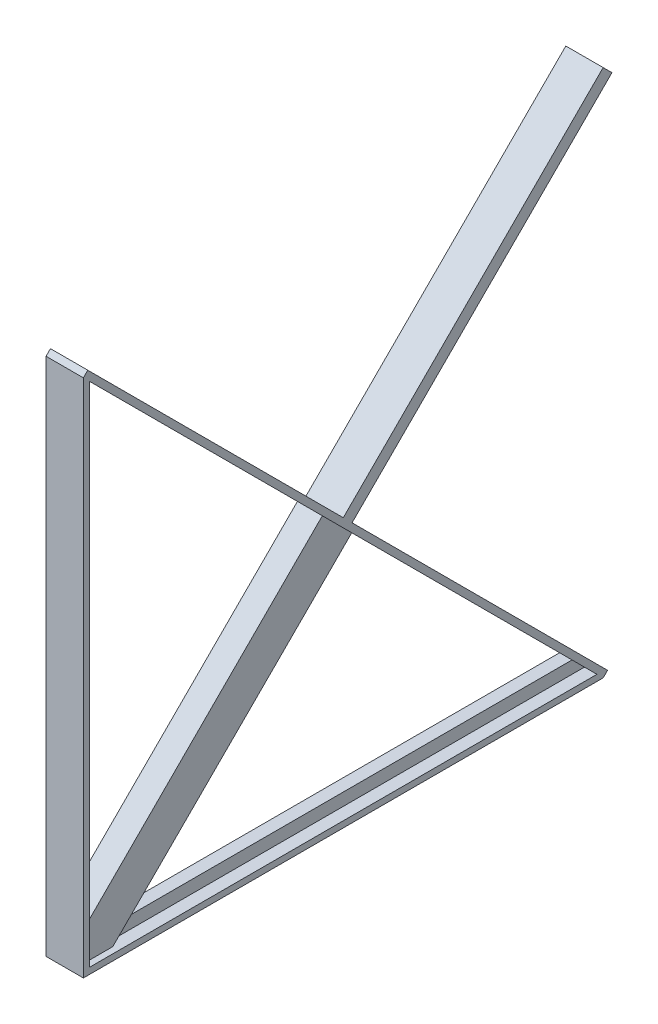
ISO-10303-21;
HEADER;
FILE_DESCRIPTION(('STEP AP214'),'2;1');
FILE_NAME('part.step','',(''),(''),'','','');
FILE_SCHEMA(('AUTOMOTIVE_DESIGN { 1 0 10303 214 1 1 1 1 }'));
ENDSEC;
DATA;
#1=APPLICATION_CONTEXT('core data for automotive mechanical design processes');
#2=APPLICATION_PROTOCOL_DEFINITION('international standard','automotive_design',2000,#1);
#3=PRODUCT_CONTEXT('',#1,'mechanical');
#4=PRODUCT('Part','Part','',(#3));
#5=PRODUCT_RELATED_PRODUCT_CATEGORY('part','',(#4));
#6=PRODUCT_DEFINITION_FORMATION('','',#4);
#7=PRODUCT_DEFINITION_CONTEXT('part definition',#1,'design');
#8=PRODUCT_DEFINITION('design','',#6,#7);
#9=PRODUCT_DEFINITION_SHAPE('','',#8);
#10=(LENGTH_UNIT() NAMED_UNIT(*) SI_UNIT(.MILLI.,.METRE.));
#11=(NAMED_UNIT(*) PLANE_ANGLE_UNIT() SI_UNIT($,.RADIAN.));
#12=(NAMED_UNIT(*) SI_UNIT($,.STERADIAN.) SOLID_ANGLE_UNIT());
#13=UNCERTAINTY_MEASURE_WITH_UNIT(LENGTH_MEASURE(1.E-05),#10,'distance_accuracy_value','');
#14=(GEOMETRIC_REPRESENTATION_CONTEXT(3) GLOBAL_UNCERTAINTY_ASSIGNED_CONTEXT((#13)) GLOBAL_UNIT_ASSIGNED_CONTEXT((#10,
#11,#12)) REPRESENTATION_CONTEXT('',''));
#15=CARTESIAN_POINT('',(0.,0.,0.));
#16=DIRECTION('',(0.,0.,1.));
#17=DIRECTION('',(1.,0.,0.));
#18=AXIS2_PLACEMENT_3D('',#15,#16,#17);
#19=CARTESIAN_POINT('',(0.,1078.62051224214,-1078.62051224214));
#20=DIRECTION('',(0.,-0.707106781186549,0.707106781186546));
#21=DIRECTION('',(0.,-0.707106781186546,-0.707106781186549));
#22=AXIS2_PLACEMENT_3D('',#19,#20,#21);
#23=PLANE('',#22);
#24=DIRECTION('',(1.,0.,0.));
#25=VECTOR('',#24,1.);
#26=CARTESIAN_POINT('',(76.2,1096.58102448428,-1060.66));
#27=LINE('',#26,#25);
#28=CARTESIAN_POINT('',(-76.2,1096.58102448428,-1060.66));
#29=VERTEX_POINT('',#28);
#30=CARTESIAN_POINT('',(76.2,1096.58102448428,-1060.66));
#31=VERTEX_POINT('',#30);
#32=EDGE_CURVE('E756',#29,#31,#27,.T.);
#33=ORIENTED_EDGE('',*,*,#32,.F.);
#34=DIRECTION('',(0.,0.707106781186546,0.707106781186549));
#35=VECTOR('',#34,1.);
#36=CARTESIAN_POINT('',(-76.2,2139.28051224214,-17.9605122421383));
#37=LINE('',#36,#35);
#38=CARTESIAN_POINT('',(-76.2,2139.28051224214,-17.9605122421383));
#39=VERTEX_POINT('',#38);
#40=EDGE_CURVE('E234',#29,#39,#37,.T.);
#41=ORIENTED_EDGE('',*,*,#40,.T.);
#42=DIRECTION('',(1.,0.,0.));
#43=VECTOR('',#42,1.);
#44=CARTESIAN_POINT('',(-76.2,2139.28051224214,-17.9605122421383));
#45=LINE('',#44,#43);
#46=CARTESIAN_POINT('',(76.2,2139.28051224214,-17.9605122421383));
#47=VERTEX_POINT('',#46);
#48=EDGE_CURVE('E321',#39,#47,#45,.T.);
#49=ORIENTED_EDGE('',*,*,#48,.T.);
#50=DIRECTION('',(0.,-0.707106781186546,-0.707106781186549));
#51=VECTOR('',#50,1.);
#52=CARTESIAN_POINT('',(76.2,2139.28051224214,-17.9605122421383));
#53=LINE('',#52,#51);
#54=EDGE_CURVE('E65',#47,#31,#53,.T.);
#55=ORIENTED_EDGE('',*,*,#54,.T.);
#56=EDGE_LOOP('',(#33,#41,#49,#55));
#57=FACE_BOUND('',#56,.T.);
#58=ADVANCED_FACE('F39',(#57),#23,.F.);
#59=DIRECTION('',(-1.,0.,0.));
#60=VECTOR('',#59,1.);
#61=CARTESIAN_POINT('',(76.2,1060.66000000001,-1096.58102448428));
#62=LINE('',#61,#60);
#63=CARTESIAN_POINT('',(76.2,1060.66000000001,-1096.58102448428));
#64=VERTEX_POINT('',#63);
#65=CARTESIAN_POINT('',(-76.2,1060.66000000001,-1096.58102448428));
#66=VERTEX_POINT('',#65);
#67=EDGE_CURVE('E57',#64,#66,#62,.T.);
#68=ORIENTED_EDGE('',*,*,#67,.F.);
#69=CARTESIAN_POINT('',(76.2,17.9605122421441,-2139.28051224214));
#70=VERTEX_POINT('',#69);
#71=EDGE_CURVE('E324',#64,#70,#53,.T.);
#72=ORIENTED_EDGE('',*,*,#71,.T.);
#73=DIRECTION('',(-1.,0.,0.));
#74=VECTOR('',#73,1.);
#75=CARTESIAN_POINT('',(-76.2,17.9605122421441,-2139.28051224214));
#76=LINE('',#75,#74);
#77=CARTESIAN_POINT('',(-76.2,17.9605122421441,-2139.28051224214));
#78=VERTEX_POINT('',#77);
#79=EDGE_CURVE('E327',#70,#78,#76,.T.);
#80=ORIENTED_EDGE('',*,*,#79,.T.);
#81=EDGE_CURVE('E318',#78,#66,#37,.T.);
#82=ORIENTED_EDGE('',*,*,#81,.T.);
#83=EDGE_LOOP('',(#68,#72,#80,#82));
#84=FACE_BOUND('',#83,.T.);
#85=ADVANCED_FACE('F471',(#84),#23,.F.);
#86=CARTESIAN_POINT('',(-25.4,0.,0.));
#87=DIRECTION('',(1.,0.,0.));
#88=DIRECTION('',(0.,0.,-1.));
#89=AXIS2_PLACEMENT_3D('',#86,#87,#88);
#90=PLANE('',#89);
#91=DIRECTION('',(0.,1.,0.));
#92=VECTOR('',#91,1.);
#93=CARTESIAN_POINT('',(-25.4,2045.12,-76.2));
#94=LINE('',#93,#92);
#95=CARTESIAN_POINT('',(-25.4,196.2,-76.2000000000004));
#96=VERTEX_POINT('',#95);
#97=CARTESIAN_POINT('',(-25.4,2045.12,-76.2));
#98=VERTEX_POINT('',#97);
#99=EDGE_CURVE('E389',#96,#98,#94,.T.);
#100=ORIENTED_EDGE('',*,*,#99,.F.);
#101=DIRECTION('',(0.,-0.707106781186548,0.707106781186548));
#102=VECTOR('',#101,1.);
#103=CARTESIAN_POINT('',(-25.4,59.9999999999999,59.9999999999999));
#104=LINE('',#103,#102);
#105=CARTESIAN_POINT('',(-25.4,145.400000000001,-25.4000000000004));
#106=VERTEX_POINT('',#105);
#107=EDGE_CURVE('E314',#96,#106,#104,.T.);
#108=ORIENTED_EDGE('',*,*,#107,.T.);
#109=DIRECTION('',(0.,-1.,0.));
#110=VECTOR('',#109,1.);
#111=CARTESIAN_POINT('',(-25.4,2095.92,-25.4));
#112=LINE('',#111,#110);
#113=CARTESIAN_POINT('',(-25.4,2095.92,-25.4000000000001));
#114=VERTEX_POINT('',#113);
#115=EDGE_CURVE('E375',#114,#106,#112,.T.);
#116=ORIENTED_EDGE('',*,*,#115,.F.);
#117=DIRECTION('',(0.,0.707106781186549,0.707106781186546));
#118=VECTOR('',#117,1.);
#119=CARTESIAN_POINT('',(-25.4,2045.12,-76.2));
#120=LINE('',#119,#118);
#121=EDGE_CURVE('E372',#98,#114,#120,.T.);
#122=ORIENTED_EDGE('',*,*,#121,.F.);
#123=EDGE_LOOP('',(#100,#108,#116,#122));
#124=FACE_BOUND('',#123,.T.);
#125=ADVANCED_FACE('F512',(#124),#90,.F.);
#126=CARTESIAN_POINT('',(25.4,0.,0.));
#127=DIRECTION('',(1.,0.,0.));
#128=DIRECTION('',(0.,0.,-1.));
#129=AXIS2_PLACEMENT_3D('',#126,#127,#128);
#130=PLANE('',#129);
#131=DIRECTION('',(0.,-0.707106781186548,0.707106781186548));
#132=VECTOR('',#131,1.);
#133=CARTESIAN_POINT('',(25.4,59.9999999999999,59.9999999999999));
#134=LINE('',#133,#132);
#135=CARTESIAN_POINT('',(25.4,196.2,-76.2000000000004));
#136=VERTEX_POINT('',#135);
#137=CARTESIAN_POINT('',(25.4,145.400000000001,-25.4000000000004));
#138=VERTEX_POINT('',#137);
#139=EDGE_CURVE('E306',#136,#138,#134,.T.);
#140=ORIENTED_EDGE('',*,*,#139,.F.);
#141=DIRECTION('',(0.,1.,0.));
#142=VECTOR('',#141,1.);
#143=CARTESIAN_POINT('',(25.4,2045.12,-76.2));
#144=LINE('',#143,#142);
#145=CARTESIAN_POINT('',(25.4,2045.12,-76.2000000000002));
#146=VERTEX_POINT('',#145);
#147=EDGE_CURVE('E369',#136,#146,#144,.T.);
#148=ORIENTED_EDGE('',*,*,#147,.T.);
#149=DIRECTION('',(0.,0.707106781186549,0.707106781186546));
#150=VECTOR('',#149,1.);
#151=CARTESIAN_POINT('',(25.4,2045.12,-76.2));
#152=LINE('',#151,#150);
#153=CARTESIAN_POINT('',(25.4,2095.92,-25.4));
#154=VERTEX_POINT('',#153);
#155=EDGE_CURVE('E351',#146,#154,#152,.T.);
#156=ORIENTED_EDGE('',*,*,#155,.T.);
#157=DIRECTION('',(0.,-1.,0.));
#158=VECTOR('',#157,1.);
#159=CARTESIAN_POINT('',(25.4,2095.92,-25.4));
#160=LINE('',#159,#158);
#161=EDGE_CURVE('E355',#154,#138,#160,.T.);
#162=ORIENTED_EDGE('',*,*,#161,.T.);
#163=EDGE_LOOP('',(#140,#148,#156,#162));
#164=FACE_BOUND('',#163,.T.);
#165=ADVANCED_FACE('F502',(#164),#130,.T.);
#166=CARTESIAN_POINT('',(-76.2,2095.92,-25.4));
#167=DIRECTION('',(0.,0.,-1.));
#168=DIRECTION('',(0.,1.,0.));
#169=AXIS2_PLACEMENT_3D('',#166,#167,#168);
#170=PLANE('',#169);
#171=DIRECTION('',(1.,0.,0.));
#172=VECTOR('',#171,1.);
#173=CARTESIAN_POINT('',(-50.8,145.4,-25.4000000000002));
#174=LINE('',#173,#172);
#175=CARTESIAN_POINT('',(-50.8,145.4,-25.4000000000002));
#176=VERTEX_POINT('',#175);
#177=EDGE_CURVE('E279',#176,#106,#174,.T.);
#178=ORIENTED_EDGE('',*,*,#177,.F.);
#179=DIRECTION('',(0.,-1.,0.));
#180=VECTOR('',#179,1.);
#181=CARTESIAN_POINT('',(-50.8,25.4,-25.4000000000002));
#182=LINE('',#181,#180);
#183=CARTESIAN_POINT('',(-50.8,25.4,-25.4000000000002));
#184=VERTEX_POINT('',#183);
#185=EDGE_CURVE('E275',#176,#184,#182,.T.);
#186=ORIENTED_EDGE('',*,*,#185,.T.);
#187=DIRECTION('',(1.,0.,0.));
#188=VECTOR('',#187,1.);
#189=CARTESIAN_POINT('',(-76.2,25.4,-25.4000000000002));
#190=LINE('',#189,#188);
#191=CARTESIAN_POINT('',(-76.2,25.4,-25.4000000000002));
#192=VERTEX_POINT('',#191);
#193=EDGE_CURVE('E438',#192,#184,#190,.T.);
#194=ORIENTED_EDGE('',*,*,#193,.F.);
#195=DIRECTION('',(0.,1.,0.));
#196=VECTOR('',#195,1.);
#197=CARTESIAN_POINT('',(-76.2,2095.92,-25.4));
#198=LINE('',#197,#196);
#199=CARTESIAN_POINT('',(-76.2,2095.92,-25.3999999999999));
#200=VERTEX_POINT('',#199);
#201=EDGE_CURVE('E423',#192,#200,#198,.T.);
#202=ORIENTED_EDGE('',*,*,#201,.T.);
#203=DIRECTION('',(1.,0.,0.));
#204=VECTOR('',#203,1.);
#205=CARTESIAN_POINT('',(-76.2,2095.92,-25.4));
#206=LINE('',#205,#204);
#207=EDGE_CURVE('E433',#200,#114,#206,.T.);
#208=ORIENTED_EDGE('',*,*,#207,.T.);
#209=ORIENTED_EDGE('',*,*,#115,.T.);
#210=EDGE_LOOP('',(#178,#186,#194,#202,#208,#209));
#211=FACE_BOUND('',#210,.T.);
#212=ADVANCED_FACE('F514',(#211),#170,.T.);
#213=CARTESIAN_POINT('',(-76.2,25.4,-25.4000000000002));
#214=DIRECTION('',(0.,1.,0.));
#215=DIRECTION('',(0.,0.,1.));
#216=AXIS2_PLACEMENT_3D('',#213,#214,#215);
#217=PLANE('',#216);
#218=DIRECTION('',(1.,0.,0.));
#219=VECTOR('',#218,1.);
#220=CARTESIAN_POINT('',(-50.8,25.4,-145.4));
#221=LINE('',#220,#219);
#222=CARTESIAN_POINT('',(-50.8,25.4,-145.4));
#223=VERTEX_POINT('',#222);
#224=CARTESIAN_POINT('',(-25.4,25.4,-145.4));
#225=VERTEX_POINT('',#224);
#226=EDGE_CURVE('E293',#223,#225,#221,.T.);
#227=ORIENTED_EDGE('',*,*,#226,.T.);
#228=DIRECTION('',(0.,0.,-1.));
#229=VECTOR('',#228,1.);
#230=CARTESIAN_POINT('',(-25.4,25.4,-25.4000000000002));
#231=LINE('',#230,#229);
#232=CARTESIAN_POINT('',(-25.4,25.4000000000105,-2095.92));
#233=VERTEX_POINT('',#232);
#234=EDGE_CURVE('E379',#225,#233,#231,.T.);
#235=ORIENTED_EDGE('',*,*,#234,.T.);
#236=DIRECTION('',(1.,0.,0.));
#237=VECTOR('',#236,1.);
#238=CARTESIAN_POINT('',(-76.2,25.4,-2095.92));
#239=LINE('',#238,#237);
#240=CARTESIAN_POINT('',(-76.2,25.3999999999999,-2095.92000000001));
#241=VERTEX_POINT('',#240);
#242=EDGE_CURVE('E442',#241,#233,#239,.T.);
#243=ORIENTED_EDGE('',*,*,#242,.F.);
#244=DIRECTION('',(0.,0.,1.));
#245=VECTOR('',#244,1.);
#246=CARTESIAN_POINT('',(-76.2,25.4,-25.4000000000002));
#247=LINE('',#246,#245);
#248=EDGE_CURVE('E419',#241,#192,#247,.T.);
#249=ORIENTED_EDGE('',*,*,#248,.T.);
#250=ORIENTED_EDGE('',*,*,#193,.T.);
#251=DIRECTION('',(0.,0.,-1.));
#252=VECTOR('',#251,1.);
#253=CARTESIAN_POINT('',(-50.8,25.4,-145.4));
#254=LINE('',#253,#252);
#255=EDGE_CURVE('E260',#184,#223,#254,.T.);
#256=ORIENTED_EDGE('',*,*,#255,.T.);
#257=EDGE_LOOP('',(#227,#235,#243,#249,#250,#256));
#258=FACE_BOUND('',#257,.T.);
#259=ADVANCED_FACE('F519',(#258),#217,.T.);
#260=CARTESIAN_POINT('',(-76.2,0.,0.));
#261=DIRECTION('',(0.,-1.,0.));
#262=DIRECTION('',(0.,0.,-1.));
#263=AXIS2_PLACEMENT_3D('',#260,#261,#262);
#264=PLANE('',#263);
#265=DIRECTION('',(1.,0.,0.));
#266=VECTOR('',#265,1.);
#267=CARTESIAN_POINT('',(-76.2,0.,-2121.32));
#268=LINE('',#267,#266);
#269=CARTESIAN_POINT('',(-76.2,5.77315972805081E-12,-2121.32000000001));
#270=VERTEX_POINT('',#269);
#271=CARTESIAN_POINT('',(76.2,5.77315972805081E-12,-2121.32000000001));
#272=VERTEX_POINT('',#271);
#273=EDGE_CURVE('E43',#270,#272,#268,.T.);
#274=ORIENTED_EDGE('',*,*,#273,.T.);
#275=DIRECTION('',(0.,0.,-1.));
#276=VECTOR('',#275,1.);
#277=CARTESIAN_POINT('',(76.2,0.,0.));
#278=LINE('',#277,#276);
#279=CARTESIAN_POINT('',(76.2,0.,0.));
#280=VERTEX_POINT('',#279);
#281=EDGE_CURVE('E397',#280,#272,#278,.T.);
#282=ORIENTED_EDGE('',*,*,#281,.F.);
#283=DIRECTION('',(1.,0.,0.));
#284=VECTOR('',#283,1.);
#285=CARTESIAN_POINT('',(-76.2,0.,0.));
#286=LINE('',#285,#284);
#287=CARTESIAN_POINT('',(-76.2,0.,0.));
#288=VERTEX_POINT('',#287);
#289=EDGE_CURVE('E11',#288,#280,#286,.T.);
#290=ORIENTED_EDGE('',*,*,#289,.F.);
#291=DIRECTION('',(0.,0.,-1.));
#292=VECTOR('',#291,1.);
#293=CARTESIAN_POINT('',(-76.2,0.,0.));
#294=LINE('',#293,#292);
#295=EDGE_CURVE('E415',#288,#270,#294,.T.);
#296=ORIENTED_EDGE('',*,*,#295,.T.);
#297=EDGE_LOOP('',(#274,#282,#290,#296));
#298=FACE_BOUND('',#297,.T.);
#299=ADVANCED_FACE('F41',(#298),#264,.T.);
#300=CARTESIAN_POINT('',(-76.2,0.,0.));
#301=DIRECTION('',(0.,0.,1.));
#302=DIRECTION('',(1.,0.,0.));
#303=AXIS2_PLACEMENT_3D('',#300,#301,#302);
#304=PLANE('',#303);
#305=ORIENTED_EDGE('',*,*,#289,.T.);
#306=DIRECTION('',(0.,-1.,0.));
#307=VECTOR('',#306,1.);
#308=CARTESIAN_POINT('',(76.2,0.,0.));
#309=LINE('',#308,#307);
#310=CARTESIAN_POINT('',(76.2,2121.32,0.));
#311=VERTEX_POINT('',#310);
#312=EDGE_CURVE('E411',#311,#280,#309,.T.);
#313=ORIENTED_EDGE('',*,*,#312,.F.);
#314=DIRECTION('',(1.,0.,0.));
#315=VECTOR('',#314,1.);
#316=CARTESIAN_POINT('',(-76.2,2121.32,0.));
#317=LINE('',#316,#315);
#318=CARTESIAN_POINT('',(-76.2,2121.32,0.));
#319=VERTEX_POINT('',#318);
#320=EDGE_CURVE('E49',#319,#311,#317,.T.);
#321=ORIENTED_EDGE('',*,*,#320,.F.);
#322=DIRECTION('',(0.,-1.,0.));
#323=VECTOR('',#322,1.);
#324=CARTESIAN_POINT('',(-76.2,0.,0.));
#325=LINE('',#324,#323);
#326=EDGE_CURVE('E427',#319,#288,#325,.T.);
#327=ORIENTED_EDGE('',*,*,#326,.T.);
#328=EDGE_LOOP('',(#305,#313,#321,#327));
#329=FACE_BOUND('',#328,.T.);
#330=ADVANCED_FACE('F467',(#329),#304,.T.);
#331=CARTESIAN_POINT('',(50.8,145.4,-25.4000000000002));
#332=VERTEX_POINT('',#331);
#333=EDGE_CURVE('E284',#138,#332,#174,.T.);
#334=ORIENTED_EDGE('',*,*,#333,.F.);
#335=ORIENTED_EDGE('',*,*,#161,.F.);
#336=CARTESIAN_POINT('',(76.2,2095.92,-25.4000000000003));
#337=VERTEX_POINT('',#336);
#338=EDGE_CURVE('E437',#154,#337,#206,.T.);
#339=ORIENTED_EDGE('',*,*,#338,.T.);
#340=DIRECTION('',(0.,1.,0.));
#341=VECTOR('',#340,1.);
#342=CARTESIAN_POINT('',(76.2,2095.92,-25.4));
#343=LINE('',#342,#341);
#344=CARTESIAN_POINT('',(76.2,25.4,-25.4000000000002));
#345=VERTEX_POINT('',#344);
#346=EDGE_CURVE('E407',#345,#337,#343,.T.);
#347=ORIENTED_EDGE('',*,*,#346,.F.);
#348=CARTESIAN_POINT('',(50.7999999999999,25.4,-25.4000000000002));
#349=VERTEX_POINT('',#348);
#350=EDGE_CURVE('E441',#349,#345,#190,.T.);
#351=ORIENTED_EDGE('',*,*,#350,.F.);
#352=DIRECTION('',(0.,-1.,0.));
#353=VECTOR('',#352,1.);
#354=CARTESIAN_POINT('',(50.8,25.4,-25.4000000000002));
#355=LINE('',#354,#353);
#356=EDGE_CURVE('E256',#332,#349,#355,.T.);
#357=ORIENTED_EDGE('',*,*,#356,.F.);
#358=EDGE_LOOP('',(#334,#335,#339,#347,#351,#357));
#359=FACE_BOUND('',#358,.T.);
#360=ADVANCED_FACE('F494',(#359),#170,.T.);
#361=CARTESIAN_POINT('',(25.4,25.4,-145.4));
#362=VERTEX_POINT('',#361);
#363=CARTESIAN_POINT('',(50.8,25.4,-145.4));
#364=VERTEX_POINT('',#363);
#365=EDGE_CURVE('E278',#362,#364,#221,.T.);
#366=ORIENTED_EDGE('',*,*,#365,.T.);
#367=DIRECTION('',(0.,0.,-1.));
#368=VECTOR('',#367,1.);
#369=CARTESIAN_POINT('',(50.8,25.4,-145.4));
#370=LINE('',#369,#368);
#371=EDGE_CURVE('E236',#349,#364,#370,.T.);
#372=ORIENTED_EDGE('',*,*,#371,.F.);
#373=ORIENTED_EDGE('',*,*,#350,.T.);
#374=DIRECTION('',(0.,0.,1.));
#375=VECTOR('',#374,1.);
#376=CARTESIAN_POINT('',(76.2,25.4,-25.4000000000002));
#377=LINE('',#376,#375);
#378=CARTESIAN_POINT('',(76.2,25.4000000000052,-2095.92000000001));
#379=VERTEX_POINT('',#378);
#380=EDGE_CURVE('E403',#379,#345,#377,.T.);
#381=ORIENTED_EDGE('',*,*,#380,.F.);
#382=CARTESIAN_POINT('',(25.4,25.4000000000105,-2095.92));
#383=VERTEX_POINT('',#382);
#384=EDGE_CURVE('E445',#383,#379,#239,.T.);
#385=ORIENTED_EDGE('',*,*,#384,.F.);
#386=DIRECTION('',(0.,0.,-1.));
#387=VECTOR('',#386,1.);
#388=CARTESIAN_POINT('',(25.4,25.4,-25.4000000000002));
#389=LINE('',#388,#387);
#390=EDGE_CURVE('E359',#362,#383,#389,.T.);
#391=ORIENTED_EDGE('',*,*,#390,.F.);
#392=EDGE_LOOP('',(#366,#372,#373,#381,#385,#391));
#393=FACE_BOUND('',#392,.T.);
#394=ADVANCED_FACE('F483',(#393),#217,.T.);
#395=CARTESIAN_POINT('',(-76.2,0.,0.));
#396=DIRECTION('',(-1.,0.,0.));
#397=DIRECTION('',(0.,0.,1.));
#398=AXIS2_PLACEMENT_3D('',#395,#396,#397);
#399=PLANE('',#398);
#400=ORIENTED_EDGE('',*,*,#248,.F.);
#401=DIRECTION('',(0.,0.707106781186546,0.707106781186549));
#402=VECTOR('',#401,1.);
#403=CARTESIAN_POINT('',(-76.2,2121.32,0.));
#404=LINE('',#403,#402);
#405=EDGE_CURVE('E317',#241,#200,#404,.T.);
#406=ORIENTED_EDGE('',*,*,#405,.T.);
#407=ORIENTED_EDGE('',*,*,#201,.F.);
#408=EDGE_LOOP('',(#400,#406,#407));
#409=FACE_BOUND('',#408,.T.);
#410=ORIENTED_EDGE('',*,*,#295,.F.);
#411=ORIENTED_EDGE('',*,*,#326,.F.);
#412=DIRECTION('',(0.,-0.707106781186549,0.707106781186546));
#413=VECTOR('',#412,1.);
#414=CARTESIAN_POINT('',(-76.2,2139.28051224214,-17.9605122421383));
#415=LINE('',#414,#413);
#416=EDGE_CURVE('E348',#39,#319,#415,.T.);
#417=ORIENTED_EDGE('',*,*,#416,.F.);
#418=ORIENTED_EDGE('',*,*,#40,.F.);
#419=DIRECTION('',(0.,-0.707106781186549,0.707106781186546));
#420=VECTOR('',#419,1.);
#421=CARTESIAN_POINT('',(-76.2,2157.24119626411,-2121.32017177982));
#422=LINE('',#421,#420);
#423=CARTESIAN_POINT('',(-76.2,2157.24119626411,-2121.32017177982));
#424=VERTEX_POINT('',#423);
#425=EDGE_CURVE('E212',#424,#29,#422,.T.);
#426=ORIENTED_EDGE('',*,*,#425,.F.);
#427=DIRECTION('',(0.,0.707106781186543,0.707106781186552));
#428=VECTOR('',#427,1.);
#429=CARTESIAN_POINT('',(-76.2,2121.32017177983,-2157.2411962641));
#430=LINE('',#429,#428);
#431=CARTESIAN_POINT('',(-76.2,2121.32017177983,-2157.2411962641));
#432=VERTEX_POINT('',#431);
#433=EDGE_CURVE('E219',#432,#424,#430,.T.);
#434=ORIENTED_EDGE('',*,*,#433,.F.);
#435=DIRECTION('',(0.,-0.707106781186549,0.707106781186546));
#436=VECTOR('',#435,1.);
#437=CARTESIAN_POINT('',(-76.2,2121.32017177983,-2157.2411962641));
#438=LINE('',#437,#436);
#439=EDGE_CURVE('E754',#432,#66,#438,.T.);
#440=ORIENTED_EDGE('',*,*,#439,.T.);
#441=ORIENTED_EDGE('',*,*,#81,.F.);
#442=DIRECTION('',(0.,-0.707106781186549,0.707106781186546));
#443=VECTOR('',#442,1.);
#444=CARTESIAN_POINT('',(-76.2,17.9605122421441,-2139.28051224214));
#445=LINE('',#444,#443);
#446=EDGE_CURVE('E330',#78,#270,#445,.T.);
#447=ORIENTED_EDGE('',*,*,#446,.T.);
#448=EDGE_LOOP('',(#410,#411,#417,#418,#426,#434,#440,#441,#447));
#449=FACE_BOUND('',#448,.T.);
#450=ADVANCED_FACE('F232',(#409,#449),#399,.T.);
#451=CARTESIAN_POINT('',(76.2,0.,0.));
#452=DIRECTION('',(-1.,0.,0.));
#453=DIRECTION('',(0.,0.,1.));
#454=AXIS2_PLACEMENT_3D('',#451,#452,#453);
#455=PLANE('',#454);
#456=DIRECTION('',(0.,-0.707106781186546,-0.707106781186549));
#457=VECTOR('',#456,1.);
#458=CARTESIAN_POINT('',(76.2,2121.32,0.));
#459=LINE('',#458,#457);
#460=EDGE_CURVE('E334',#337,#379,#459,.T.);
#461=ORIENTED_EDGE('',*,*,#460,.T.);
#462=ORIENTED_EDGE('',*,*,#380,.T.);
#463=ORIENTED_EDGE('',*,*,#346,.T.);
#464=EDGE_LOOP('',(#461,#462,#463));
#465=FACE_BOUND('',#464,.T.);
#466=ORIENTED_EDGE('',*,*,#281,.T.);
#467=DIRECTION('',(0.,-0.707106781186549,0.707106781186546));
#468=VECTOR('',#467,1.);
#469=CARTESIAN_POINT('',(76.2,17.9605122421441,-2139.28051224214));
#470=LINE('',#469,#468);
#471=EDGE_CURVE('E341',#70,#272,#470,.T.);
#472=ORIENTED_EDGE('',*,*,#471,.F.);
#473=ORIENTED_EDGE('',*,*,#71,.F.);
#474=DIRECTION('',(0.,-0.707106781186549,0.707106781186546));
#475=VECTOR('',#474,1.);
#476=CARTESIAN_POINT('',(76.2,2121.32017177983,-2157.2411962641));
#477=LINE('',#476,#475);
#478=CARTESIAN_POINT('',(76.2,2121.32017177983,-2157.2411962641));
#479=VERTEX_POINT('',#478);
#480=EDGE_CURVE('E243',#479,#64,#477,.T.);
#481=ORIENTED_EDGE('',*,*,#480,.F.);
#482=DIRECTION('',(0.,-0.707106781186543,-0.707106781186552));
#483=VECTOR('',#482,1.);
#484=CARTESIAN_POINT('',(76.2,2121.32017177983,-2157.2411962641));
#485=LINE('',#484,#483);
#486=CARTESIAN_POINT('',(76.2,2157.24119626411,-2121.32017177982));
#487=VERTEX_POINT('',#486);
#488=EDGE_CURVE('E218',#487,#479,#485,.T.);
#489=ORIENTED_EDGE('',*,*,#488,.F.);
#490=DIRECTION('',(0.,-0.707106781186549,0.707106781186546));
#491=VECTOR('',#490,1.);
#492=CARTESIAN_POINT('',(76.2,2157.24119626411,-2121.32017177982));
#493=LINE('',#492,#491);
#494=EDGE_CURVE('E214',#487,#31,#493,.T.);
#495=ORIENTED_EDGE('',*,*,#494,.T.);
#496=ORIENTED_EDGE('',*,*,#54,.F.);
#497=DIRECTION('',(0.,-0.707106781186549,0.707106781186546));
#498=VECTOR('',#497,1.);
#499=CARTESIAN_POINT('',(76.2,2139.28051224214,-17.9605122421383));
#500=LINE('',#499,#498);
#501=EDGE_CURVE('E344',#47,#311,#500,.T.);
#502=ORIENTED_EDGE('',*,*,#501,.T.);
#503=ORIENTED_EDGE('',*,*,#312,.T.);
#504=EDGE_LOOP('',(#466,#472,#473,#481,#489,#495,#496,#502,#503));
#505=FACE_BOUND('',#504,.T.);
#506=ADVANCED_FACE('F461',(#465,#505),#455,.F.);
#507=CARTESIAN_POINT('',(-25.4,2045.12,-76.2));
#508=DIRECTION('',(0.,0.,-1.));
#509=DIRECTION('',(0.,1.,0.));
#510=AXIS2_PLACEMENT_3D('',#507,#508,#509);
#511=PLANE('',#510);
#512=DIRECTION('',(1.,0.,0.));
#513=VECTOR('',#512,1.);
#514=CARTESIAN_POINT('',(-25.4,196.2,-76.2000000000002));
#515=LINE('',#514,#513);
#516=EDGE_CURVE('E310',#96,#136,#515,.T.);
#517=ORIENTED_EDGE('',*,*,#516,.F.);
#518=ORIENTED_EDGE('',*,*,#99,.T.);
#519=DIRECTION('',(1.,0.,0.));
#520=VECTOR('',#519,1.);
#521=CARTESIAN_POINT('',(-25.4,2045.12,-76.2));
#522=LINE('',#521,#520);
#523=EDGE_CURVE('E393',#98,#146,#522,.T.);
#524=ORIENTED_EDGE('',*,*,#523,.T.);
#525=ORIENTED_EDGE('',*,*,#147,.F.);
#526=EDGE_LOOP('',(#517,#518,#524,#525));
#527=FACE_BOUND('',#526,.T.);
#528=ADVANCED_FACE('F505',(#527),#511,.T.);
#529=CARTESIAN_POINT('',(-25.4,76.2,-76.2000000000003));
#530=DIRECTION('',(0.,1.,0.));
#531=DIRECTION('',(0.,0.,1.));
#532=AXIS2_PLACEMENT_3D('',#529,#530,#531);
#533=PLANE('',#532);
#534=DIRECTION('',(-1.,0.,0.));
#535=VECTOR('',#534,1.);
#536=CARTESIAN_POINT('',(-25.4,76.2,-196.2));
#537=LINE('',#536,#535);
#538=CARTESIAN_POINT('',(25.4,76.2,-196.2));
#539=VERTEX_POINT('',#538);
#540=CARTESIAN_POINT('',(-25.4,76.2,-196.2));
#541=VERTEX_POINT('',#540);
#542=EDGE_CURVE('E299',#539,#541,#537,.T.);
#543=ORIENTED_EDGE('',*,*,#542,.F.);
#544=DIRECTION('',(0.,0.,1.));
#545=VECTOR('',#544,1.);
#546=CARTESIAN_POINT('',(25.4,76.2,-76.2000000000003));
#547=LINE('',#546,#545);
#548=CARTESIAN_POINT('',(25.4,76.2,-2045.12));
#549=VERTEX_POINT('',#548);
#550=EDGE_CURVE('E366',#549,#539,#547,.T.);
#551=ORIENTED_EDGE('',*,*,#550,.F.);
#552=DIRECTION('',(1.,0.,0.));
#553=VECTOR('',#552,1.);
#554=CARTESIAN_POINT('',(-25.4,76.2,-2045.12));
#555=LINE('',#554,#553);
#556=CARTESIAN_POINT('',(-25.4,76.2,-2045.12000000001));
#557=VERTEX_POINT('',#556);
#558=EDGE_CURVE('E392',#557,#549,#555,.T.);
#559=ORIENTED_EDGE('',*,*,#558,.F.);
#560=DIRECTION('',(0.,0.,1.));
#561=VECTOR('',#560,1.);
#562=CARTESIAN_POINT('',(-25.4,76.2,-76.2000000000003));
#563=LINE('',#562,#561);
#564=EDGE_CURVE('E385',#557,#541,#563,.T.);
#565=ORIENTED_EDGE('',*,*,#564,.T.);
#566=EDGE_LOOP('',(#543,#551,#559,#565));
#567=FACE_BOUND('',#566,.T.);
#568=ADVANCED_FACE('F530',(#567),#533,.T.);
#569=ORIENTED_EDGE('',*,*,#234,.F.);
#570=DIRECTION('',(0.,0.707106781186547,-0.707106781186548));
#571=VECTOR('',#570,1.);
#572=CARTESIAN_POINT('',(-25.4,-60.0000000000001,-60.0000000000001));
#573=LINE('',#572,#571);
#574=EDGE_CURVE('E303',#225,#541,#573,.T.);
#575=ORIENTED_EDGE('',*,*,#574,.T.);
#576=ORIENTED_EDGE('',*,*,#564,.F.);
#577=DIRECTION('',(0.,0.707106781186546,0.707106781186549));
#578=VECTOR('',#577,1.);
#579=CARTESIAN_POINT('',(-25.4,76.2,-2045.12));
#580=LINE('',#579,#578);
#581=EDGE_CURVE('E382',#233,#557,#580,.T.);
#582=ORIENTED_EDGE('',*,*,#581,.F.);
#583=EDGE_LOOP('',(#569,#575,#576,#582));
#584=FACE_BOUND('',#583,.T.);
#585=ADVANCED_FACE('F524',(#584),#90,.F.);
#586=DIRECTION('',(0.,0.707106781186547,-0.707106781186548));
#587=VECTOR('',#586,1.);
#588=CARTESIAN_POINT('',(25.4,-60.0000000000001,-60.0000000000001));
#589=LINE('',#588,#587);
#590=EDGE_CURVE('E283',#362,#539,#589,.T.);
#591=ORIENTED_EDGE('',*,*,#590,.F.);
#592=ORIENTED_EDGE('',*,*,#390,.T.);
#593=DIRECTION('',(0.,0.707106781186546,0.707106781186549));
#594=VECTOR('',#593,1.);
#595=CARTESIAN_POINT('',(25.4,76.2,-2045.12));
#596=LINE('',#595,#594);
#597=EDGE_CURVE('E362',#383,#549,#596,.T.);
#598=ORIENTED_EDGE('',*,*,#597,.T.);
#599=ORIENTED_EDGE('',*,*,#550,.T.);
#600=EDGE_LOOP('',(#591,#592,#598,#599));
#601=FACE_BOUND('',#600,.T.);
#602=ADVANCED_FACE('F533',(#601),#130,.T.);
#603=CARTESIAN_POINT('',(-76.2,2139.28051224214,-17.9605122421383));
#604=DIRECTION('',(0.,-0.707106781186546,-0.707106781186549));
#605=DIRECTION('',(0.,0.707106781186549,-0.707106781186546));
#606=AXIS2_PLACEMENT_3D('',#603,#604,#605);
#607=PLANE('',#606);
#608=ORIENTED_EDGE('',*,*,#320,.T.);
#609=ORIENTED_EDGE('',*,*,#501,.F.);
#610=ORIENTED_EDGE('',*,*,#48,.F.);
#611=ORIENTED_EDGE('',*,*,#416,.T.);
#612=EDGE_LOOP('',(#608,#609,#610,#611));
#613=FACE_BOUND('',#612,.T.);
#614=ADVANCED_FACE('F535',(#613),#607,.F.);
#615=CARTESIAN_POINT('',(-76.2,17.9605122421441,-2139.28051224214));
#616=DIRECTION('',(0.,0.707106781186546,0.707106781186549));
#617=DIRECTION('',(0.,-0.707106781186549,0.707106781186546));
#618=AXIS2_PLACEMENT_3D('',#615,#616,#617);
#619=PLANE('',#618);
#620=ORIENTED_EDGE('',*,*,#273,.F.);
#621=ORIENTED_EDGE('',*,*,#446,.F.);
#622=ORIENTED_EDGE('',*,*,#79,.F.);
#623=ORIENTED_EDGE('',*,*,#471,.T.);
#624=EDGE_LOOP('',(#620,#621,#622,#623));
#625=FACE_BOUND('',#624,.T.);
#626=ADVANCED_FACE('F470',(#625),#619,.F.);
#627=CARTESIAN_POINT('',(0.,1060.66000000001,-1060.66));
#628=DIRECTION('',(0.,-0.707106781186549,0.707106781186546));
#629=DIRECTION('',(0.,-0.707106781186546,-0.707106781186549));
#630=AXIS2_PLACEMENT_3D('',#627,#628,#629);
#631=PLANE('',#630);
#632=DIRECTION('',(0.,0.707106781186549,0.707106781186546));
#633=VECTOR('',#632,1.);
#634=CARTESIAN_POINT('',(-50.8,1120.66,-1000.66));
#635=LINE('',#634,#633);
#636=CARTESIAN_POINT('',(-50.8,1000.66,-1120.66));
#637=VERTEX_POINT('',#636);
#638=CARTESIAN_POINT('',(-50.8,1120.66,-1000.66));
#639=VERTEX_POINT('',#638);
#640=EDGE_CURVE('E267',#637,#639,#635,.T.);
#641=ORIENTED_EDGE('',*,*,#640,.T.);
#642=DIRECTION('',(1.,0.,0.));
#643=VECTOR('',#642,1.);
#644=CARTESIAN_POINT('',(-50.8,1120.66,-1000.66));
#645=LINE('',#644,#643);
#646=CARTESIAN_POINT('',(50.8,1120.66,-1000.66));
#647=VERTEX_POINT('',#646);
#648=EDGE_CURVE('E285',#639,#647,#645,.T.);
#649=ORIENTED_EDGE('',*,*,#648,.T.);
#650=DIRECTION('',(0.,0.707106781186549,0.707106781186546));
#651=VECTOR('',#650,1.);
#652=CARTESIAN_POINT('',(50.8,1120.66,-1000.66));
#653=LINE('',#652,#651);
#654=CARTESIAN_POINT('',(50.8,1000.66000000001,-1120.66));
#655=VERTEX_POINT('',#654);
#656=EDGE_CURVE('E249',#655,#647,#653,.T.);
#657=ORIENTED_EDGE('',*,*,#656,.F.);
#658=DIRECTION('',(1.,0.,0.));
#659=VECTOR('',#658,1.);
#660=CARTESIAN_POINT('',(-50.8,1000.66,-1120.66));
#661=LINE('',#660,#659);
#662=EDGE_CURVE('E289',#637,#655,#661,.T.);
#663=ORIENTED_EDGE('',*,*,#662,.F.);
#664=EDGE_LOOP('',(#641,#649,#657,#663));
#665=FACE_BOUND('',#664,.T.);
#666=ORIENTED_EDGE('',*,*,#121,.T.);
#667=ORIENTED_EDGE('',*,*,#207,.F.);
#668=ORIENTED_EDGE('',*,*,#405,.F.);
#669=ORIENTED_EDGE('',*,*,#242,.T.);
#670=ORIENTED_EDGE('',*,*,#581,.T.);
#671=ORIENTED_EDGE('',*,*,#558,.T.);
#672=ORIENTED_EDGE('',*,*,#597,.F.);
#673=ORIENTED_EDGE('',*,*,#384,.T.);
#674=ORIENTED_EDGE('',*,*,#460,.F.);
#675=ORIENTED_EDGE('',*,*,#338,.F.);
#676=ORIENTED_EDGE('',*,*,#155,.F.);
#677=ORIENTED_EDGE('',*,*,#523,.F.);
#678=EDGE_LOOP('',(#666,#667,#668,#669,#670,#671,#672,#673,#674,#675,#676,#677));
#679=FACE_BOUND('',#678,.T.);
#680=ADVANCED_FACE('F509',(#665,#679),#631,.T.);
#681=CARTESIAN_POINT('',(-50.8,145.4,-25.4000000000002));
#682=DIRECTION('',(0.,0.707106781186548,0.707106781186548));
#683=DIRECTION('',(0.,-0.707106781186548,0.707106781186548));
#684=AXIS2_PLACEMENT_3D('',#681,#682,#683);
#685=PLANE('',#684);
#686=ORIENTED_EDGE('',*,*,#107,.F.);
#687=ORIENTED_EDGE('',*,*,#516,.T.);
#688=ORIENTED_EDGE('',*,*,#139,.T.);
#689=ORIENTED_EDGE('',*,*,#333,.T.);
#690=DIRECTION('',(0.,-0.707106781186548,0.707106781186548));
#691=VECTOR('',#690,1.);
#692=CARTESIAN_POINT('',(50.8,145.4,-25.4000000000002));
#693=LINE('',#692,#691);
#694=EDGE_CURVE('E252',#647,#332,#693,.T.);
#695=ORIENTED_EDGE('',*,*,#694,.F.);
#696=ORIENTED_EDGE('',*,*,#648,.F.);
#697=DIRECTION('',(0.,-0.707106781186548,0.707106781186548));
#698=VECTOR('',#697,1.);
#699=CARTESIAN_POINT('',(-50.8,145.4,-25.4000000000002));
#700=LINE('',#699,#698);
#701=EDGE_CURVE('E271',#639,#176,#700,.T.);
#702=ORIENTED_EDGE('',*,*,#701,.T.);
#703=ORIENTED_EDGE('',*,*,#177,.T.);
#704=EDGE_LOOP('',(#686,#687,#688,#689,#695,#696,#702,#703));
#705=FACE_BOUND('',#704,.T.);
#706=ADVANCED_FACE('F499',(#705),#685,.T.);
#707=CARTESIAN_POINT('',(-50.8,1000.66,-1120.66));
#708=DIRECTION('',(0.,-0.707106781186548,-0.707106781186547));
#709=DIRECTION('',(0.,0.707106781186547,-0.707106781186548));
#710=AXIS2_PLACEMENT_3D('',#707,#708,#709);
#711=PLANE('',#710);
#712=ORIENTED_EDGE('',*,*,#574,.F.);
#713=ORIENTED_EDGE('',*,*,#226,.F.);
#714=DIRECTION('',(0.,0.707106781186547,-0.707106781186548));
#715=VECTOR('',#714,1.);
#716=CARTESIAN_POINT('',(-50.8,1000.66,-1120.66));
#717=LINE('',#716,#715);
#718=EDGE_CURVE('E263',#223,#637,#717,.T.);
#719=ORIENTED_EDGE('',*,*,#718,.T.);
#720=ORIENTED_EDGE('',*,*,#662,.T.);
#721=DIRECTION('',(0.,0.707106781186547,-0.707106781186548));
#722=VECTOR('',#721,1.);
#723=CARTESIAN_POINT('',(50.8,1000.66,-1120.66));
#724=LINE('',#723,#722);
#725=EDGE_CURVE('E241',#364,#655,#724,.T.);
#726=ORIENTED_EDGE('',*,*,#725,.F.);
#727=ORIENTED_EDGE('',*,*,#365,.F.);
#728=ORIENTED_EDGE('',*,*,#590,.T.);
#729=ORIENTED_EDGE('',*,*,#542,.T.);
#730=EDGE_LOOP('',(#712,#713,#719,#720,#726,#727,#728,#729));
#731=FACE_BOUND('',#730,.T.);
#732=ADVANCED_FACE('F487',(#731),#711,.T.);
#733=CARTESIAN_POINT('',(-50.8,0.,0.));
#734=DIRECTION('',(-1.,0.,0.));
#735=DIRECTION('',(0.,0.,1.));
#736=AXIS2_PLACEMENT_3D('',#733,#734,#735);
#737=PLANE('',#736);
#738=ORIENTED_EDGE('',*,*,#255,.F.);
#739=ORIENTED_EDGE('',*,*,#185,.F.);
#740=ORIENTED_EDGE('',*,*,#701,.F.);
#741=ORIENTED_EDGE('',*,*,#640,.F.);
#742=ORIENTED_EDGE('',*,*,#718,.F.);
#743=EDGE_LOOP('',(#738,#739,#740,#741,#742));
#744=FACE_BOUND('',#743,.T.);
#745=ADVANCED_FACE('F578',(#744),#737,.T.);
#746=CARTESIAN_POINT('',(50.8,0.,0.));
#747=DIRECTION('',(-1.,0.,0.));
#748=DIRECTION('',(0.,0.,1.));
#749=AXIS2_PLACEMENT_3D('',#746,#747,#748);
#750=PLANE('',#749);
#751=ORIENTED_EDGE('',*,*,#371,.T.);
#752=ORIENTED_EDGE('',*,*,#725,.T.);
#753=ORIENTED_EDGE('',*,*,#656,.T.);
#754=ORIENTED_EDGE('',*,*,#694,.T.);
#755=ORIENTED_EDGE('',*,*,#356,.T.);
#756=EDGE_LOOP('',(#751,#752,#753,#754,#755));
#757=FACE_BOUND('',#756,.T.);
#758=ADVANCED_FACE('F491',(#757),#750,.F.);
#759=CARTESIAN_POINT('',(76.2,2157.24119626411,-2121.32017177982));
#760=DIRECTION('',(0.,-0.707106781186546,-0.707106781186549));
#761=DIRECTION('',(0.,0.707106781186549,-0.707106781186546));
#762=AXIS2_PLACEMENT_3D('',#759,#760,#761);
#763=PLANE('',#762);
#764=ORIENTED_EDGE('',*,*,#32,.T.);
#765=ORIENTED_EDGE('',*,*,#494,.F.);
#766=DIRECTION('',(1.,0.,0.));
#767=VECTOR('',#766,1.);
#768=CARTESIAN_POINT('',(76.2,2157.24119626411,-2121.32017177982));
#769=LINE('',#768,#767);
#770=EDGE_CURVE('E208',#424,#487,#769,.T.);
#771=ORIENTED_EDGE('',*,*,#770,.F.);
#772=ORIENTED_EDGE('',*,*,#425,.T.);
#773=EDGE_LOOP('',(#764,#765,#771,#772));
#774=FACE_BOUND('',#773,.T.);
#775=ADVANCED_FACE('F210',(#774),#763,.F.);
#776=CARTESIAN_POINT('',(76.2,2121.32017177983,-2157.2411962641));
#777=DIRECTION('',(0.,0.707106781186546,0.707106781186549));
#778=DIRECTION('',(0.,-0.707106781186549,0.707106781186546));
#779=AXIS2_PLACEMENT_3D('',#776,#777,#778);
#780=PLANE('',#779);
#781=ORIENTED_EDGE('',*,*,#67,.T.);
#782=ORIENTED_EDGE('',*,*,#439,.F.);
#783=DIRECTION('',(-1.,0.,0.));
#784=VECTOR('',#783,1.);
#785=CARTESIAN_POINT('',(76.2,2121.32017177983,-2157.2411962641));
#786=LINE('',#785,#784);
#787=EDGE_CURVE('E224',#479,#432,#786,.T.);
#788=ORIENTED_EDGE('',*,*,#787,.F.);
#789=ORIENTED_EDGE('',*,*,#480,.T.);
#790=EDGE_LOOP('',(#781,#782,#788,#789));
#791=FACE_BOUND('',#790,.T.);
#792=ADVANCED_FACE('F618',(#791),#780,.F.);
#793=CARTESIAN_POINT('',(0.,2139.28068402197,-2139.28068402195));
#794=DIRECTION('',(0.,-0.707106781186552,0.707106781186543));
#795=DIRECTION('',(0.,-0.707106781186543,-0.707106781186552));
#796=AXIS2_PLACEMENT_3D('',#793,#794,#795);
#797=PLANE('',#796);
#798=ORIENTED_EDGE('',*,*,#433,.T.);
#799=ORIENTED_EDGE('',*,*,#770,.T.);
#800=ORIENTED_EDGE('',*,*,#488,.T.);
#801=ORIENTED_EDGE('',*,*,#787,.T.);
#802=EDGE_LOOP('',(#798,#799,#800,#801));
#803=FACE_BOUND('',#802,.T.);
#804=ADVANCED_FACE('F222',(#803),#797,.F.);
#805=CLOSED_SHELL('',(#58,#85,#125,#165,#212,#259,#299,#330,#360,#394,#450,#506,#528,#568,#585,
#602,#614,#626,#680,#706,#732,#745,#758,#775,#792,#804));
#806=MANIFOLD_SOLID_BREP('B2',#805);
#807=ADVANCED_BREP_SHAPE_REPRESENTATION('',(#18,#806),#14);
#808=SHAPE_DEFINITION_REPRESENTATION(#9,#807);
ENDSEC;
END-ISO-10303-21;
